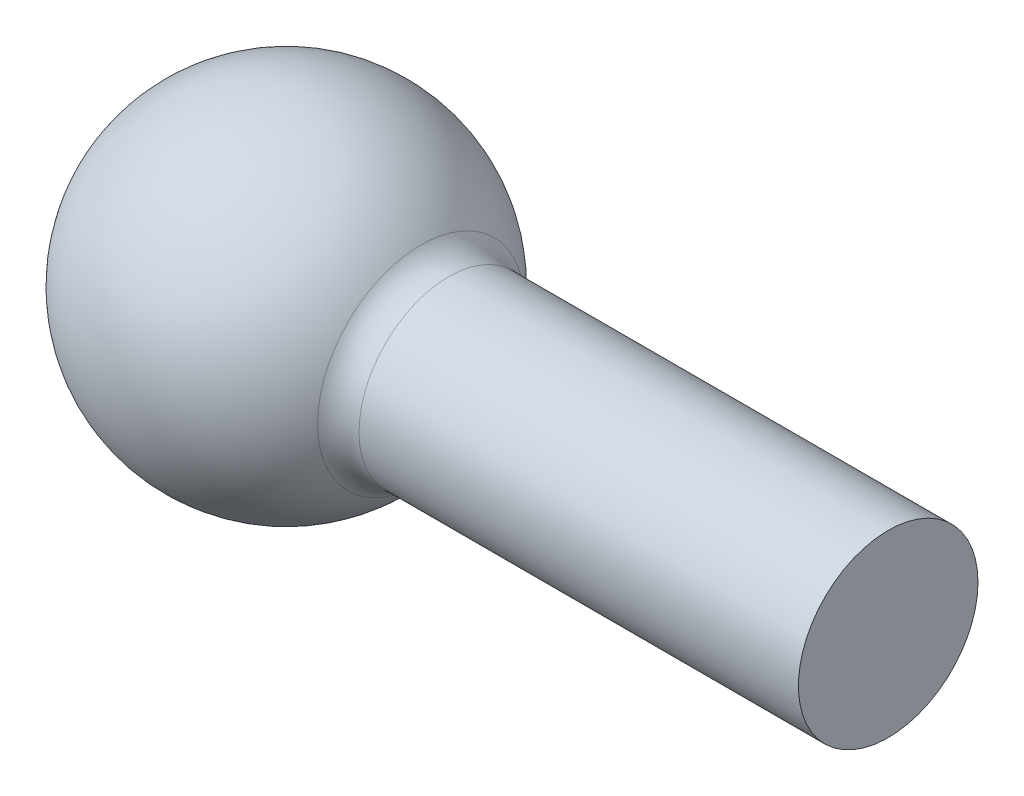
ISO-10303-21;
HEADER;
FILE_DESCRIPTION(('STEP AP214'),'2;1');
FILE_NAME('part.step','',(''),(''),'','','');
FILE_SCHEMA(('AUTOMOTIVE_DESIGN { 1 0 10303 214 1 1 1 1 }'));
ENDSEC;
DATA;
#1=APPLICATION_CONTEXT('core data for automotive mechanical design processes');
#2=APPLICATION_PROTOCOL_DEFINITION('international standard','automotive_design',2000,#1);
#3=PRODUCT_CONTEXT('',#1,'mechanical');
#4=PRODUCT('Part','Part','',(#3));
#5=PRODUCT_RELATED_PRODUCT_CATEGORY('part','',(#4));
#6=PRODUCT_DEFINITION_FORMATION('','',#4);
#7=PRODUCT_DEFINITION_CONTEXT('part definition',#1,'design');
#8=PRODUCT_DEFINITION('design','',#6,#7);
#9=PRODUCT_DEFINITION_SHAPE('','',#8);
#10=(LENGTH_UNIT() NAMED_UNIT(*) SI_UNIT(.MILLI.,.METRE.));
#11=(NAMED_UNIT(*) PLANE_ANGLE_UNIT() SI_UNIT($,.RADIAN.));
#12=(NAMED_UNIT(*) SI_UNIT($,.STERADIAN.) SOLID_ANGLE_UNIT());
#13=UNCERTAINTY_MEASURE_WITH_UNIT(LENGTH_MEASURE(1.E-05),#10,'distance_accuracy_value','');
#14=(GEOMETRIC_REPRESENTATION_CONTEXT(3) GLOBAL_UNCERTAINTY_ASSIGNED_CONTEXT((#13)) GLOBAL_UNIT_ASSIGNED_CONTEXT((#10,
#11,#12)) REPRESENTATION_CONTEXT('',''));
#15=CARTESIAN_POINT('',(0.,0.,0.));
#16=DIRECTION('',(0.,0.,1.));
#17=DIRECTION('',(1.,0.,0.));
#18=AXIS2_PLACEMENT_3D('',#15,#16,#17);
#19=CARTESIAN_POINT('',(60.7060792015001,0.,-25.));
#20=DIRECTION('',(1.,0.,0.));
#21=DIRECTION('',(0.,0.,-1.));
#22=AXIS2_PLACEMENT_3D('',#19,#20,#21);
#23=PLANE('',#22);
#24=CARTESIAN_POINT('',(60.7060792015001,0.,-12.15));
#25=DIRECTION('',(1.,0.,0.));
#26=DIRECTION('',(0.,0.,-1.));
#27=AXIS2_PLACEMENT_3D('',#24,#25,#26);
#28=CIRCLE('',#27,12.85);
#29=CARTESIAN_POINT('',(60.7060792015001,0.,-25.));
#30=VERTEX_POINT('',#29);
#31=EDGE_CURVE('E53',#30,#30,#28,.T.);
#32=ORIENTED_EDGE('',*,*,#31,.T.);
#33=EDGE_LOOP('',(#32));
#34=FACE_BOUND('',#33,.T.);
#35=ADVANCED_FACE('F42',(#34),#23,.T.);
#36=CARTESIAN_POINT('',(60.7060792015001,0.,-12.15));
#37=DIRECTION('',(1.,0.,0.));
#38=DIRECTION('',(0.,0.,-1.));
#39=AXIS2_PLACEMENT_3D('',#36,#37,#38);
#40=CYLINDRICAL_SURFACE('',#39,12.85);
#41=CARTESIAN_POINT('',(-2.18194034312179,0.,-12.15));
#42=DIRECTION('',(-1.,0.,0.));
#43=DIRECTION('',(0.,0.,1.));
#44=AXIS2_PLACEMENT_3D('',#41,#42,#43);
#45=CIRCLE('',#44,12.85);
#46=CARTESIAN_POINT('',(-2.18194034312179,0.,0.69999999999998));
#47=VERTEX_POINT('',#46);
#48=EDGE_CURVE('E49',#47,#47,#45,.F.);
#49=ORIENTED_EDGE('',*,*,#48,.T.);
#50=EDGE_LOOP('',(#49));
#51=FACE_BOUND('',#50,.T.);
#52=ORIENTED_EDGE('',*,*,#31,.F.);
#53=EDGE_LOOP('',(#52));
#54=FACE_BOUND('',#53,.T.);
#55=ADVANCED_FACE('F61',(#51,#54),#40,.T.);
#56=CARTESIAN_POINT('',(-25.4378747828496,0.,-12.15));
#57=DIRECTION('',(1.,0.,0.));
#58=DIRECTION('',(0.,0.,-1.));
#59=AXIS2_PLACEMENT_3D('',#56,#57,#58);
#60=SPHERICAL_SURFACE('',#59,24.3165650556971);
#61=CARTESIAN_POINT('',(-6.1482874229289,0.,-12.15));
#62=DIRECTION('',(-1.,0.,0.));
#63=DIRECTION('',(0.,0.,1.));
#64=AXIS2_PLACEMENT_3D('',#61,#62,#63);
#65=CIRCLE('',#64,14.8056460714126);
#66=CARTESIAN_POINT('',(-6.1482874229289,0.,2.65564607141257));
#67=VERTEX_POINT('',#66);
#68=EDGE_CURVE('E10',#67,#67,#65,.T.);
#69=ORIENTED_EDGE('',*,*,#68,.T.);
#70=EDGE_LOOP('',(#69));
#71=FACE_BOUND('',#70,.T.);
#72=ADVANCED_FACE('F63',(#71),#60,.T.);
#73=CARTESIAN_POINT('',(-2.18194034312179,0.,-12.15));
#74=DIRECTION('',(-1.,0.,0.));
#75=DIRECTION('',(0.,0.,1.));
#76=AXIS2_PLACEMENT_3D('',#73,#74,#75);
#77=TOROIDAL_SURFACE('',#76,17.85,5.);
#78=ORIENTED_EDGE('',*,*,#68,.F.);
#79=EDGE_LOOP('',(#78));
#80=FACE_BOUND('',#79,.T.);
#81=ORIENTED_EDGE('',*,*,#48,.F.);
#82=EDGE_LOOP('',(#81));
#83=FACE_BOUND('',#82,.T.);
#84=ADVANCED_FACE('F44',(#80,#83),#77,.F.);
#85=CLOSED_SHELL('',(#35,#55,#72,#84));
#86=MANIFOLD_SOLID_BREP('B2',#85);
#87=ADVANCED_BREP_SHAPE_REPRESENTATION('',(#18,#86),#14);
#88=SHAPE_DEFINITION_REPRESENTATION(#9,#87);
ENDSEC;
END-ISO-10303-21;
